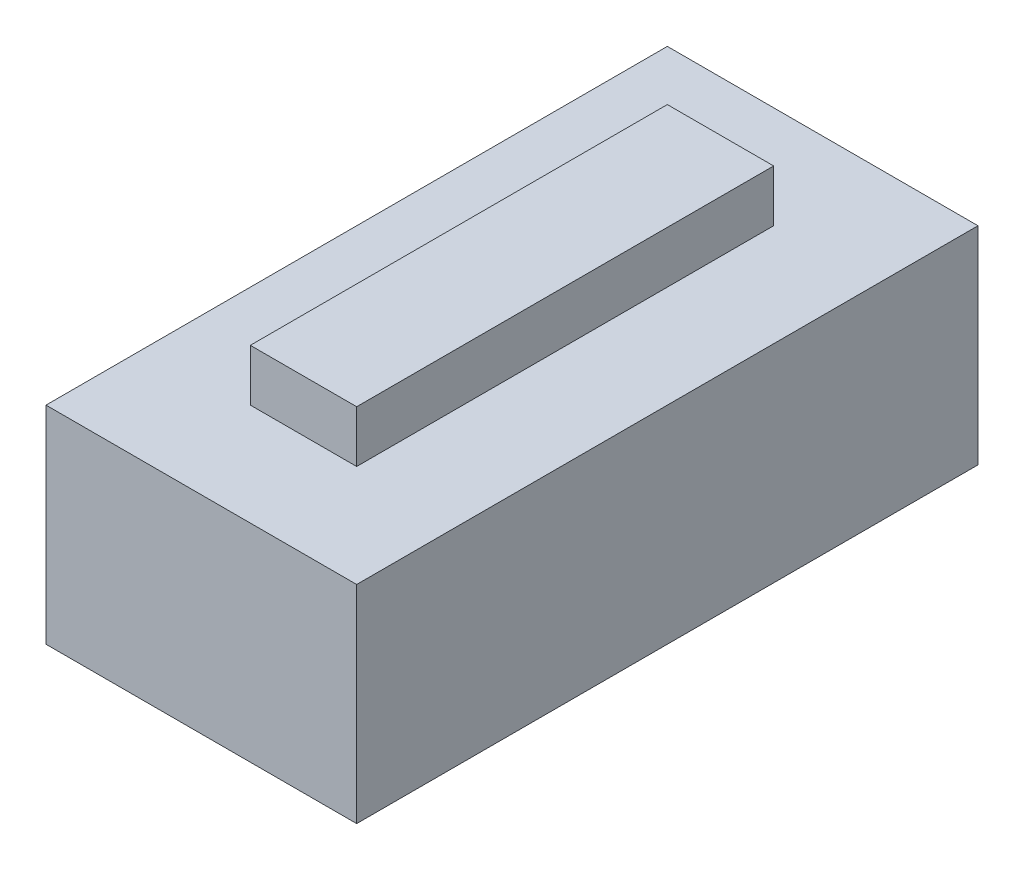
ISO-10303-21;
HEADER;
FILE_DESCRIPTION(('STEP AP214'),'2;1');
FILE_NAME('part.step','',(''),(''),'','','');
FILE_SCHEMA(('AUTOMOTIVE_DESIGN { 1 0 10303 214 1 1 1 1 }'));
ENDSEC;
DATA;
#1=APPLICATION_CONTEXT('core data for automotive mechanical design processes');
#2=APPLICATION_PROTOCOL_DEFINITION('international standard','automotive_design',2000,#1);
#3=PRODUCT_CONTEXT('',#1,'mechanical');
#4=PRODUCT('Part','Part','',(#3));
#5=PRODUCT_RELATED_PRODUCT_CATEGORY('part','',(#4));
#6=PRODUCT_DEFINITION_FORMATION('','',#4);
#7=PRODUCT_DEFINITION_CONTEXT('part definition',#1,'design');
#8=PRODUCT_DEFINITION('design','',#6,#7);
#9=PRODUCT_DEFINITION_SHAPE('','',#8);
#10=(LENGTH_UNIT() NAMED_UNIT(*) SI_UNIT(.MILLI.,.METRE.));
#11=(NAMED_UNIT(*) PLANE_ANGLE_UNIT() SI_UNIT($,.RADIAN.));
#12=(NAMED_UNIT(*) SI_UNIT($,.STERADIAN.) SOLID_ANGLE_UNIT());
#13=UNCERTAINTY_MEASURE_WITH_UNIT(LENGTH_MEASURE(1.E-05),#10,'distance_accuracy_value','');
#14=(GEOMETRIC_REPRESENTATION_CONTEXT(3) GLOBAL_UNCERTAINTY_ASSIGNED_CONTEXT((#13)) GLOBAL_UNIT_ASSIGNED_CONTEXT((#10,
#11,#12)) REPRESENTATION_CONTEXT('',''));
#15=CARTESIAN_POINT('',(0.,0.,0.));
#16=DIRECTION('',(0.,0.,1.));
#17=DIRECTION('',(1.,0.,0.));
#18=AXIS2_PLACEMENT_3D('',#15,#16,#17);
#19=CARTESIAN_POINT('',(-4.43132054060698,5.50000004055861,-39.1298540681601));
#20=DIRECTION('',(0.,0.,-1.));
#21=DIRECTION('',(0.,-1.,0.));
#22=AXIS2_PLACEMENT_3D('',#19,#20,#21);
#23=PLANE('',#22);
#24=DIRECTION('',(1.,0.,0.));
#25=VECTOR('',#24,1.);
#26=CARTESIAN_POINT('',(3.27780229315332,3.50000004055861,-39.1298540681601));
#27=LINE('',#26,#25);
#28=CARTESIAN_POINT('',(-4.43132054060698,3.50000004055861,-39.1298540681601));
#29=VERTEX_POINT('',#28);
#30=CARTESIAN_POINT('',(-1.43132049590349,3.50000004055861,-39.1298540681601));
#31=VERTEX_POINT('',#30);
#32=EDGE_CURVE('E157',#29,#31,#27,.T.);
#33=ORIENTED_EDGE('',*,*,#32,.T.);
#34=DIRECTION('',(0.,-1.,0.));
#35=VECTOR('',#34,1.);
#36=CARTESIAN_POINT('',(-1.43132049590349,5.50000004055861,-39.1298540681601));
#37=LINE('',#36,#35);
#38=CARTESIAN_POINT('',(-1.43132049590349,1.49999995944139,-39.1298540681601));
#39=VERTEX_POINT('',#38);
#40=EDGE_CURVE('E11',#31,#39,#37,.T.);
#41=ORIENTED_EDGE('',*,*,#40,.T.);
#42=DIRECTION('',(1.,0.,0.));
#43=VECTOR('',#42,1.);
#44=CARTESIAN_POINT('',(-2.21566027030349,1.5,-39.1298540681601));
#45=LINE('',#44,#43);
#46=CARTESIAN_POINT('',(-4.43132054060698,1.49999995944139,-39.1298540681601));
#47=VERTEX_POINT('',#46);
#48=EDGE_CURVE('E136',#47,#39,#45,.T.);
#49=ORIENTED_EDGE('',*,*,#48,.F.);
#50=DIRECTION('',(0.,-1.,0.));
#51=VECTOR('',#50,1.);
#52=CARTESIAN_POINT('',(-4.43132054060698,5.50000004055861,-39.1298540681601));
#53=LINE('',#52,#51);
#54=EDGE_CURVE('E27',#29,#47,#53,.T.);
#55=ORIENTED_EDGE('',*,*,#54,.F.);
#56=EDGE_LOOP('',(#33,#41,#49,#55));
#57=FACE_BOUND('',#56,.T.);
#58=ADVANCED_FACE('F17',(#57),#23,.T.);
#59=CARTESIAN_POINT('',(-1.43132049590349,5.50000004055861,-39.1298540681601));
#60=DIRECTION('',(1.,0.,0.));
#61=DIRECTION('',(0.,1.,0.));
#62=AXIS2_PLACEMENT_3D('',#59,#60,#61);
#63=PLANE('',#62);
#64=DIRECTION('',(0.,0.,1.));
#65=VECTOR('',#64,1.);
#66=CARTESIAN_POINT('',(-1.43132049590349,3.50000004055861,-23.2105978149711));
#67=LINE('',#66,#65);
#68=CARTESIAN_POINT('',(-1.43132049590349,3.50000004055861,-33.1298539787531));
#69=VERTEX_POINT('',#68);
#70=EDGE_CURVE('E154',#31,#69,#67,.T.);
#71=ORIENTED_EDGE('',*,*,#70,.T.);
#72=DIRECTION('',(0.,-1.,0.));
#73=VECTOR('',#72,1.);
#74=CARTESIAN_POINT('',(-1.43132049590349,5.50000004055861,-33.1298539787531));
#75=LINE('',#74,#73);
#76=CARTESIAN_POINT('',(-1.43132049590349,1.49999995944139,-33.1298539787531));
#77=VERTEX_POINT('',#76);
#78=EDGE_CURVE('E163',#69,#77,#75,.T.);
#79=ORIENTED_EDGE('',*,*,#78,.T.);
#80=DIRECTION('',(0.,0.,1.));
#81=VECTOR('',#80,1.);
#82=CARTESIAN_POINT('',(-1.43132049590349,1.5,-19.56492703408));
#83=LINE('',#82,#81);
#84=EDGE_CURVE('E194',#39,#77,#83,.T.);
#85=ORIENTED_EDGE('',*,*,#84,.F.);
#86=ORIENTED_EDGE('',*,*,#40,.F.);
#87=EDGE_LOOP('',(#71,#79,#85,#86));
#88=FACE_BOUND('',#87,.T.);
#89=ADVANCED_FACE('F277',(#88),#63,.T.);
#90=CARTESIAN_POINT('',(-4.43132054060698,5.50000004055861,-33.1298539787531));
#91=DIRECTION('',(-1.,0.,0.));
#92=DIRECTION('',(0.,0.,1.));
#93=AXIS2_PLACEMENT_3D('',#90,#91,#92);
#94=PLANE('',#93);
#95=DIRECTION('',(0.,0.,-1.));
#96=VECTOR('',#95,1.);
#97=CARTESIAN_POINT('',(-4.43132054060697,3.50000004055861,-20.2105977702676));
#98=LINE('',#97,#96);
#99=CARTESIAN_POINT('',(-4.43132054060698,3.50000004055861,-33.1298539787531));
#100=VERTEX_POINT('',#99);
#101=EDGE_CURVE('E106',#100,#29,#98,.T.);
#102=ORIENTED_EDGE('',*,*,#101,.T.);
#103=ORIENTED_EDGE('',*,*,#54,.T.);
#104=DIRECTION('',(0.,0.,-1.));
#105=VECTOR('',#104,1.);
#106=CARTESIAN_POINT('',(-4.43132054060698,1.5,-16.5649269893765));
#107=LINE('',#106,#105);
#108=CARTESIAN_POINT('',(-4.43132054060698,1.49999995944139,-33.1298539787531));
#109=VERTEX_POINT('',#108);
#110=EDGE_CURVE('E132',#109,#47,#107,.T.);
#111=ORIENTED_EDGE('',*,*,#110,.F.);
#112=DIRECTION('',(0.,-1.,0.));
#113=VECTOR('',#112,1.);
#114=CARTESIAN_POINT('',(-4.43132054060698,5.50000004055861,-33.1298539787531));
#115=LINE('',#114,#113);
#116=EDGE_CURVE('E171',#100,#109,#115,.T.);
#117=ORIENTED_EDGE('',*,*,#116,.F.);
#118=EDGE_LOOP('',(#102,#103,#111,#117));
#119=FACE_BOUND('',#118,.T.);
#120=ADVANCED_FACE('F275',(#119),#94,.T.);
#121=CARTESIAN_POINT('',(-1.43132049590349,5.50000004055861,-33.1298539787531));
#122=DIRECTION('',(0.,0.,1.));
#123=DIRECTION('',(1.,0.,0.));
#124=AXIS2_PLACEMENT_3D('',#121,#122,#123);
#125=PLANE('',#124);
#126=DIRECTION('',(-1.,0.,0.));
#127=VECTOR('',#126,1.);
#128=CARTESIAN_POINT('',(4.77780231550506,3.50000004055861,-33.1298539787531));
#129=LINE('',#128,#127);
#130=EDGE_CURVE('E142',#69,#100,#129,.T.);
#131=ORIENTED_EDGE('',*,*,#130,.T.);
#132=ORIENTED_EDGE('',*,*,#116,.T.);
#133=DIRECTION('',(-1.,0.,0.));
#134=VECTOR('',#133,1.);
#135=CARTESIAN_POINT('',(-0.715660247951746,1.5,-33.1298539787531));
#136=LINE('',#135,#134);
#137=EDGE_CURVE('E131',#77,#109,#136,.T.);
#138=ORIENTED_EDGE('',*,*,#137,.F.);
#139=ORIENTED_EDGE('',*,*,#78,.F.);
#140=EDGE_LOOP('',(#131,#132,#138,#139));
#141=FACE_BOUND('',#140,.T.);
#142=ADVANCED_FACE('F272',(#141),#125,.T.);
#143=CARTESIAN_POINT('',(10.9869251269136,3.50000004055861,-7.29134156178215));
#144=DIRECTION('',(0.,-1.,0.));
#145=DIRECTION('',(0.,0.,-1.));
#146=AXIS2_PLACEMENT_3D('',#143,#144,#145);
#147=PLANE('',#146);
#148=DIRECTION('',(1.,0.,0.));
#149=VECTOR('',#148,1.);
#150=CARTESIAN_POINT('',(3.77108865187963,3.50000004055861,-38.1432813507074));
#151=LINE('',#150,#149);
#152=CARTESIAN_POINT('',(-3.44474782315435,3.5,-38.1432813507074));
#153=VERTEX_POINT('',#152);
#154=CARTESIAN_POINT('',(-2.41789321335612,3.5,-38.1432813507074));
#155=VERTEX_POINT('',#154);
#156=EDGE_CURVE('E137',#153,#155,#151,.T.);
#157=ORIENTED_EDGE('',*,*,#156,.T.);
#158=DIRECTION('',(0.,0.,1.));
#159=VECTOR('',#158,1.);
#160=CARTESIAN_POINT('',(-2.41789321335612,3.50000004055861,-22.7173114562448));
#161=LINE('',#160,#159);
#162=CARTESIAN_POINT('',(-2.41789321335612,3.5,-34.1164266962057));
#163=VERTEX_POINT('',#162);
#164=EDGE_CURVE('E101',#155,#163,#161,.T.);
#165=ORIENTED_EDGE('',*,*,#164,.T.);
#166=DIRECTION('',(-1.,0.,0.));
#167=VECTOR('',#166,1.);
#168=CARTESIAN_POINT('',(4.28451595677875,3.50000004055861,-34.1164266962057));
#169=LINE('',#168,#167);
#170=CARTESIAN_POINT('',(-3.44474782315435,3.5,-34.1164266962057));
#171=VERTEX_POINT('',#170);
#172=EDGE_CURVE('E93',#163,#171,#169,.T.);
#173=ORIENTED_EDGE('',*,*,#172,.T.);
#174=DIRECTION('',(0.,0.,-1.));
#175=VECTOR('',#174,1.);
#176=CARTESIAN_POINT('',(-3.44474782315435,3.50000004055861,-20.7038841289939));
#177=LINE('',#176,#175);
#178=EDGE_CURVE('E99',#171,#153,#177,.T.);
#179=ORIENTED_EDGE('',*,*,#178,.T.);
#180=EDGE_LOOP('',(#157,#165,#173,#179));
#181=FACE_BOUND('',#180,.T.);
#182=ORIENTED_EDGE('',*,*,#101,.F.);
#183=ORIENTED_EDGE('',*,*,#130,.F.);
#184=ORIENTED_EDGE('',*,*,#70,.F.);
#185=ORIENTED_EDGE('',*,*,#32,.F.);
#186=EDGE_LOOP('',(#182,#183,#184,#185));
#187=FACE_BOUND('',#186,.T.);
#188=ADVANCED_FACE('F96',(#181,#187),#147,.F.);
#189=CARTESIAN_POINT('',(-2.41789321335612,5.50000004055861,-34.1164266962057));
#190=DIRECTION('',(0.,0.,1.));
#191=DIRECTION('',(1.,0.,0.));
#192=AXIS2_PLACEMENT_3D('',#189,#190,#191);
#193=PLANE('',#192);
#194=DIRECTION('',(-1.,0.,0.));
#195=VECTOR('',#194,1.);
#196=CARTESIAN_POINT('',(4.28451595677875,4.00000004055861,-34.1164266962057));
#197=LINE('',#196,#195);
#198=CARTESIAN_POINT('',(-2.41789321335612,4.00000004055861,-34.1164266962057));
#199=VERTEX_POINT('',#198);
#200=CARTESIAN_POINT('',(-3.44474782315435,4.00000004055861,-34.1164266962057));
#201=VERTEX_POINT('',#200);
#202=EDGE_CURVE('E112',#199,#201,#197,.T.);
#203=ORIENTED_EDGE('',*,*,#202,.T.);
#204=DIRECTION('',(0.,-1.,0.));
#205=VECTOR('',#204,1.);
#206=CARTESIAN_POINT('',(-3.44474782315435,5.50000004055861,-34.1164266962057));
#207=LINE('',#206,#205);
#208=EDGE_CURVE('E107',#201,#171,#207,.T.);
#209=ORIENTED_EDGE('',*,*,#208,.T.);
#210=ORIENTED_EDGE('',*,*,#172,.F.);
#211=DIRECTION('',(0.,-1.,0.));
#212=VECTOR('',#211,1.);
#213=CARTESIAN_POINT('',(-2.41789321335612,5.50000004055861,-34.1164266962057));
#214=LINE('',#213,#212);
#215=EDGE_CURVE('E127',#199,#163,#214,.T.);
#216=ORIENTED_EDGE('',*,*,#215,.F.);
#217=EDGE_LOOP('',(#203,#209,#210,#216));
#218=FACE_BOUND('',#217,.T.);
#219=ADVANCED_FACE('F110',(#218),#193,.T.);
#220=CARTESIAN_POINT('',(-3.44474782315435,5.50000004055861,-34.1164266962057));
#221=DIRECTION('',(-1.,0.,0.));
#222=DIRECTION('',(0.,0.,1.));
#223=AXIS2_PLACEMENT_3D('',#220,#221,#222);
#224=PLANE('',#223);
#225=DIRECTION('',(0.,0.,-1.));
#226=VECTOR('',#225,1.);
#227=CARTESIAN_POINT('',(-3.44474782315435,4.00000004055861,-20.7038841289939));
#228=LINE('',#227,#226);
#229=CARTESIAN_POINT('',(-3.44474782315435,4.00000004055861,-38.1432813507074));
#230=VERTEX_POINT('',#229);
#231=EDGE_CURVE('E179',#201,#230,#228,.T.);
#232=ORIENTED_EDGE('',*,*,#231,.T.);
#233=DIRECTION('',(0.,-1.,0.));
#234=VECTOR('',#233,1.);
#235=CARTESIAN_POINT('',(-3.44474782315435,5.50000004055861,-38.1432813507074));
#236=LINE('',#235,#234);
#237=EDGE_CURVE('E119',#230,#153,#236,.T.);
#238=ORIENTED_EDGE('',*,*,#237,.T.);
#239=ORIENTED_EDGE('',*,*,#178,.F.);
#240=ORIENTED_EDGE('',*,*,#208,.F.);
#241=EDGE_LOOP('',(#232,#238,#239,#240));
#242=FACE_BOUND('',#241,.T.);
#243=ADVANCED_FACE('F118',(#242),#224,.T.);
#244=CARTESIAN_POINT('',(-2.41789321335612,5.50000004055861,-38.1432813507074));
#245=DIRECTION('',(1.,0.,0.));
#246=DIRECTION('',(0.,1.,0.));
#247=AXIS2_PLACEMENT_3D('',#244,#245,#246);
#248=PLANE('',#247);
#249=DIRECTION('',(0.,0.,1.));
#250=VECTOR('',#249,1.);
#251=CARTESIAN_POINT('',(-2.41789321335612,4.00000004055861,-22.7173114562448));
#252=LINE('',#251,#250);
#253=CARTESIAN_POINT('',(-2.41789321335612,4.00000004055861,-38.1432813507074));
#254=VERTEX_POINT('',#253);
#255=EDGE_CURVE('E190',#254,#199,#252,.T.);
#256=ORIENTED_EDGE('',*,*,#255,.T.);
#257=ORIENTED_EDGE('',*,*,#215,.T.);
#258=ORIENTED_EDGE('',*,*,#164,.F.);
#259=DIRECTION('',(0.,-1.,0.));
#260=VECTOR('',#259,1.);
#261=CARTESIAN_POINT('',(-2.41789321335612,5.50000004055861,-38.1432813507074));
#262=LINE('',#261,#260);
#263=EDGE_CURVE('E20',#254,#155,#262,.T.);
#264=ORIENTED_EDGE('',*,*,#263,.F.);
#265=EDGE_LOOP('',(#256,#257,#258,#264));
#266=FACE_BOUND('',#265,.T.);
#267=ADVANCED_FACE('F200',(#266),#248,.T.);
#268=CARTESIAN_POINT('',(-3.44474782315435,5.50000004055861,-38.1432813507074));
#269=DIRECTION('',(0.,0.,-1.));
#270=DIRECTION('',(0.,-1.,0.));
#271=AXIS2_PLACEMENT_3D('',#268,#269,#270);
#272=PLANE('',#271);
#273=DIRECTION('',(1.,0.,0.));
#274=VECTOR('',#273,1.);
#275=CARTESIAN_POINT('',(3.77108865187963,4.00000004055861,-38.1432813507074));
#276=LINE('',#275,#274);
#277=EDGE_CURVE('E182',#230,#254,#276,.T.);
#278=ORIENTED_EDGE('',*,*,#277,.T.);
#279=ORIENTED_EDGE('',*,*,#263,.T.);
#280=ORIENTED_EDGE('',*,*,#156,.F.);
#281=ORIENTED_EDGE('',*,*,#237,.F.);
#282=EDGE_LOOP('',(#278,#279,#280,#281));
#283=FACE_BOUND('',#282,.T.);
#284=ADVANCED_FACE('F207',(#283),#272,.T.);
#285=CARTESIAN_POINT('',(10.9869251269136,4.00000004055861,-7.29134156178215));
#286=DIRECTION('',(0.,-1.,0.));
#287=DIRECTION('',(0.,0.,-1.));
#288=AXIS2_PLACEMENT_3D('',#285,#286,#287);
#289=PLANE('',#288);
#290=ORIENTED_EDGE('',*,*,#255,.F.);
#291=ORIENTED_EDGE('',*,*,#277,.F.);
#292=ORIENTED_EDGE('',*,*,#231,.F.);
#293=ORIENTED_EDGE('',*,*,#202,.F.);
#294=EDGE_LOOP('',(#290,#291,#292,#293));
#295=FACE_BOUND('',#294,.T.);
#296=ADVANCED_FACE('F205',(#295),#289,.F.);
#297=CARTESIAN_POINT('',(-2.655,1.5,-0.520482398309197));
#298=DIRECTION('',(0.,1.,0.));
#299=DIRECTION('',(1.,0.,0.));
#300=AXIS2_PLACEMENT_3D('',#297,#298,#299);
#301=PLANE('',#300);
#302=ORIENTED_EDGE('',*,*,#137,.T.);
#303=ORIENTED_EDGE('',*,*,#110,.T.);
#304=ORIENTED_EDGE('',*,*,#48,.T.);
#305=ORIENTED_EDGE('',*,*,#84,.T.);
#306=EDGE_LOOP('',(#302,#303,#304,#305));
#307=FACE_BOUND('',#306,.T.);
#308=ADVANCED_FACE('F270',(#307),#301,.F.);
#309=CLOSED_SHELL('',(#58,#89,#120,#142,#188,#219,#243,#267,#284,#296,#308));
#310=MANIFOLD_SOLID_BREP('B1',#309);
#311=ADVANCED_BREP_SHAPE_REPRESENTATION('',(#18,#310),#14);
#312=SHAPE_DEFINITION_REPRESENTATION(#9,#311);
ENDSEC;
END-ISO-10303-21;
